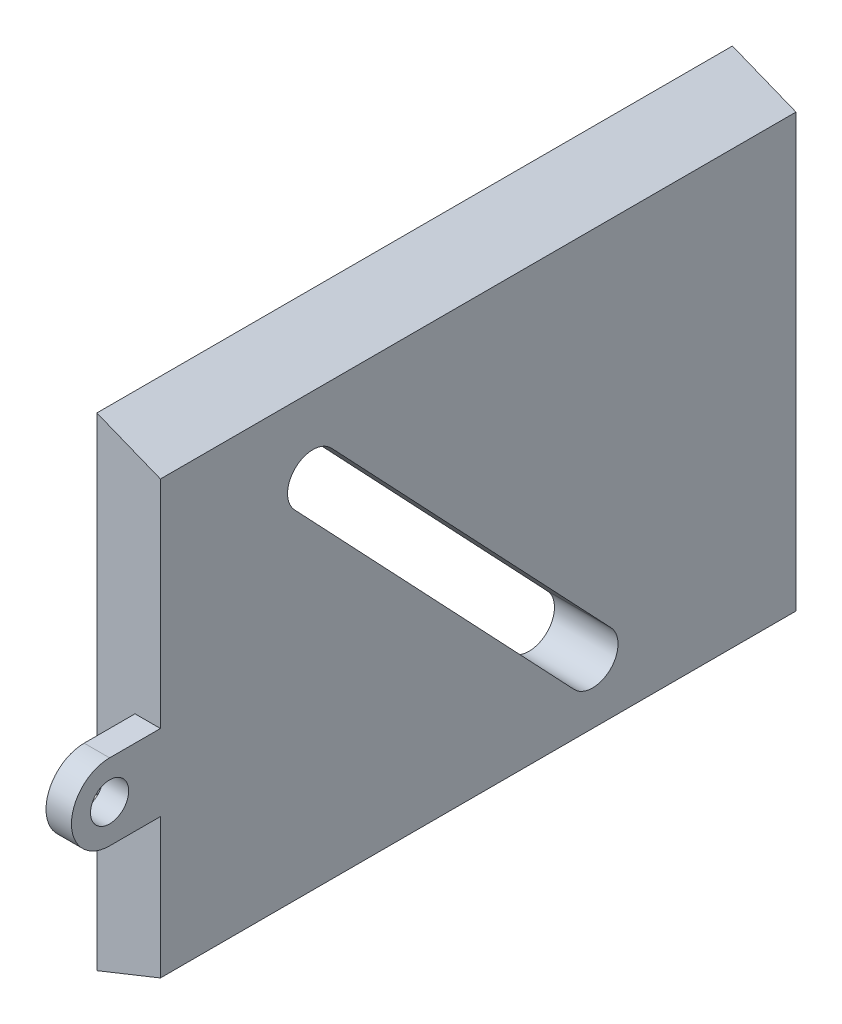
ISO-10303-21;
HEADER;
FILE_DESCRIPTION(('STEP AP214'),'2;1');
FILE_NAME('part.step','',(''),(''),'','','');
FILE_SCHEMA(('AUTOMOTIVE_DESIGN { 1 0 10303 214 1 1 1 1 }'));
ENDSEC;
DATA;
#1=APPLICATION_CONTEXT('core data for automotive mechanical design processes');
#2=APPLICATION_PROTOCOL_DEFINITION('international standard','automotive_design',2000,#1);
#3=PRODUCT_CONTEXT('',#1,'mechanical');
#4=PRODUCT('Part','Part','',(#3));
#5=PRODUCT_RELATED_PRODUCT_CATEGORY('part','',(#4));
#6=PRODUCT_DEFINITION_FORMATION('','',#4);
#7=PRODUCT_DEFINITION_CONTEXT('part definition',#1,'design');
#8=PRODUCT_DEFINITION('design','',#6,#7);
#9=PRODUCT_DEFINITION_SHAPE('','',#8);
#10=(LENGTH_UNIT() NAMED_UNIT(*) SI_UNIT(.MILLI.,.METRE.));
#11=(NAMED_UNIT(*) PLANE_ANGLE_UNIT() SI_UNIT($,.RADIAN.));
#12=(NAMED_UNIT(*) SI_UNIT($,.STERADIAN.) SOLID_ANGLE_UNIT());
#13=UNCERTAINTY_MEASURE_WITH_UNIT(LENGTH_MEASURE(1.E-05),#10,'distance_accuracy_value','');
#14=(GEOMETRIC_REPRESENTATION_CONTEXT(3) GLOBAL_UNCERTAINTY_ASSIGNED_CONTEXT((#13)) GLOBAL_UNIT_ASSIGNED_CONTEXT((#10,
#11,#12)) REPRESENTATION_CONTEXT('',''));
#15=CARTESIAN_POINT('',(0.,0.,0.));
#16=DIRECTION('',(0.,0.,1.));
#17=DIRECTION('',(1.,0.,0.));
#18=AXIS2_PLACEMENT_3D('',#15,#16,#17);
#19=CARTESIAN_POINT('',(4.99999999999999,2.,50.));
#20=DIRECTION('',(-1.,0.,0.));
#21=DIRECTION('',(0.,0.,1.));
#22=AXIS2_PLACEMENT_3D('',#19,#20,#21);
#23=PLANE('',#22);
#24=DIRECTION('',(0.,-0.726184377413891,-0.6875));
#25=VECTOR('',#24,1.);
#26=CARTESIAN_POINT('',(5.,28.625,39.4523687548278));
#27=LINE('',#26,#25);
#28=CARTESIAN_POINT('',(4.99999999999999,28.625,39.4523687548278));
#29=VERTEX_POINT('',#28);
#30=CARTESIAN_POINT('',(4.99999999999999,5.38709992275552,17.4523687548278));
#31=VERTEX_POINT('',#30);
#32=EDGE_CURVE('E148',#29,#31,#27,.T.);
#33=ORIENTED_EDGE('',*,*,#32,.F.);
#34=CARTESIAN_POINT('',(5.,30.,38.));
#35=DIRECTION('',(1.,0.,0.));
#36=DIRECTION('',(0.,1.,0.));
#37=AXIS2_PLACEMENT_3D('',#34,#35,#36);
#38=CIRCLE('',#37,1.99999999999999);
#39=CARTESIAN_POINT('',(5.,31.375,36.5476312451722));
#40=VERTEX_POINT('',#39);
#41=EDGE_CURVE('E48',#40,#29,#38,.T.);
#42=ORIENTED_EDGE('',*,*,#41,.F.);
#43=DIRECTION('',(0.,0.72618437741389,0.6875));
#44=VECTOR('',#43,1.);
#45=CARTESIAN_POINT('',(5.,31.375,36.5476312451722));
#46=LINE('',#45,#44);
#47=CARTESIAN_POINT('',(4.99999999999999,8.13709992275552,14.5476312451722));
#48=VERTEX_POINT('',#47);
#49=EDGE_CURVE('E139',#48,#40,#46,.T.);
#50=ORIENTED_EDGE('',*,*,#49,.F.);
#51=CARTESIAN_POINT('',(4.99999999999999,6.76209992275552,16.));
#52=DIRECTION('',(1.,0.,0.));
#53=DIRECTION('',(0.,1.,0.));
#54=AXIS2_PLACEMENT_3D('',#51,#52,#53);
#55=CIRCLE('',#54,2.);
#56=EDGE_CURVE('E142',#31,#48,#55,.T.);
#57=ORIENTED_EDGE('',*,*,#56,.F.);
#58=EDGE_LOOP('',(#33,#42,#50,#57));
#59=FACE_BOUND('',#58,.T.);
#60=DIRECTION('',(0.,1.,0.));
#61=VECTOR('',#60,1.);
#62=CARTESIAN_POINT('',(4.99999999999999,2.,50.));
#63=LINE('',#62,#61);
#64=CARTESIAN_POINT('',(5.,19.,50.));
#65=VERTEX_POINT('',#64);
#66=CARTESIAN_POINT('',(4.99999999999999,36.,50.));
#67=VERTEX_POINT('',#66);
#68=EDGE_CURVE('E195',#65,#67,#63,.T.);
#69=ORIENTED_EDGE('',*,*,#68,.F.);
#70=DIRECTION('',(0.,0.,1.));
#71=VECTOR('',#70,1.);
#72=CARTESIAN_POINT('',(5.,19.,50.));
#73=LINE('',#72,#71);
#74=CARTESIAN_POINT('',(5.,19.,54.));
#75=VERTEX_POINT('',#74);
#76=EDGE_CURVE('E161',#65,#75,#73,.T.);
#77=ORIENTED_EDGE('',*,*,#76,.T.);
#78=CARTESIAN_POINT('',(5.,16.,54.));
#79=DIRECTION('',(1.,0.,0.));
#80=DIRECTION('',(0.,1.,0.));
#81=AXIS2_PLACEMENT_3D('',#78,#79,#80);
#82=CIRCLE('',#81,3.);
#83=CARTESIAN_POINT('',(5.,13.,54.));
#84=VERTEX_POINT('',#83);
#85=EDGE_CURVE('E177',#75,#84,#82,.T.);
#86=ORIENTED_EDGE('',*,*,#85,.T.);
#87=DIRECTION('',(0.,0.,-1.));
#88=VECTOR('',#87,1.);
#89=CARTESIAN_POINT('',(5.,13.,50.));
#90=LINE('',#89,#88);
#91=CARTESIAN_POINT('',(4.99999999999999,13.,50.));
#92=VERTEX_POINT('',#91);
#93=EDGE_CURVE('E168',#84,#92,#90,.T.);
#94=ORIENTED_EDGE('',*,*,#93,.T.);
#95=CARTESIAN_POINT('',(4.99999999999999,2.,50.));
#96=VERTEX_POINT('',#95);
#97=EDGE_CURVE('E192',#96,#92,#63,.T.);
#98=ORIENTED_EDGE('',*,*,#97,.F.);
#99=DIRECTION('',(0.,0.,-1.));
#100=VECTOR('',#99,1.);
#101=CARTESIAN_POINT('',(4.99999999999999,2.,50.));
#102=LINE('',#101,#100);
#103=CARTESIAN_POINT('',(4.99999999999999,2.,0.));
#104=VERTEX_POINT('',#103);
#105=EDGE_CURVE('E201',#96,#104,#102,.T.);
#106=ORIENTED_EDGE('',*,*,#105,.T.);
#107=DIRECTION('',(0.,1.,0.));
#108=VECTOR('',#107,1.);
#109=CARTESIAN_POINT('',(4.99999999999999,2.,0.));
#110=LINE('',#109,#108);
#111=CARTESIAN_POINT('',(4.99999999999999,36.,0.));
#112=VERTEX_POINT('',#111);
#113=EDGE_CURVE('E185',#104,#112,#110,.T.);
#114=ORIENTED_EDGE('',*,*,#113,.T.);
#115=DIRECTION('',(0.,0.,-1.));
#116=VECTOR('',#115,1.);
#117=CARTESIAN_POINT('',(4.99999999999999,36.,50.));
#118=LINE('',#117,#116);
#119=EDGE_CURVE('E41',#67,#112,#118,.T.);
#120=ORIENTED_EDGE('',*,*,#119,.F.);
#121=EDGE_LOOP('',(#69,#77,#86,#94,#98,#106,#114,#120));
#122=FACE_BOUND('',#121,.T.);
#123=CARTESIAN_POINT('',(5.,16.,54.));
#124=DIRECTION('',(1.,0.,0.));
#125=DIRECTION('',(0.,1.,0.));
#126=AXIS2_PLACEMENT_3D('',#123,#124,#125);
#127=CIRCLE('',#126,1.5);
#128=CARTESIAN_POINT('',(5.,17.5,54.));
#129=VERTEX_POINT('',#128);
#130=EDGE_CURVE('E154',#129,#129,#127,.T.);
#131=ORIENTED_EDGE('',*,*,#130,.F.);
#132=EDGE_LOOP('',(#131));
#133=FACE_BOUND('',#132,.T.);
#134=ADVANCED_FACE('F34',(#59,#122,#133),#23,.F.);
#135=CARTESIAN_POINT('',(4.99999999999999,36.,50.));
#136=DIRECTION('',(-0.371390676354105,-0.928476690885259,0.));
#137=DIRECTION('',(0.928476690885259,-0.371390676354105,0.));
#138=AXIS2_PLACEMENT_3D('',#135,#136,#137);
#139=PLANE('',#138);
#140=DIRECTION('',(-0.928476690885259,0.371390676354105,0.));
#141=VECTOR('',#140,1.);
#142=CARTESIAN_POINT('',(4.99999999999999,36.,0.));
#143=LINE('',#142,#141);
#144=CARTESIAN_POINT('',(0.,38.,0.));
#145=VERTEX_POINT('',#144);
#146=EDGE_CURVE('E204',#112,#145,#143,.T.);
#147=ORIENTED_EDGE('',*,*,#146,.T.);
#148=DIRECTION('',(0.,0.,-1.));
#149=VECTOR('',#148,1.);
#150=CARTESIAN_POINT('',(0.,38.,50.));
#151=LINE('',#150,#149);
#152=CARTESIAN_POINT('',(0.,38.,50.));
#153=VERTEX_POINT('',#152);
#154=EDGE_CURVE('E215',#153,#145,#151,.T.);
#155=ORIENTED_EDGE('',*,*,#154,.F.);
#156=DIRECTION('',(-0.928476690885259,0.371390676354105,0.));
#157=VECTOR('',#156,1.);
#158=CARTESIAN_POINT('',(4.99999999999999,36.,50.));
#159=LINE('',#158,#157);
#160=EDGE_CURVE('E194',#67,#153,#159,.T.);
#161=ORIENTED_EDGE('',*,*,#160,.F.);
#162=ORIENTED_EDGE('',*,*,#119,.T.);
#163=EDGE_LOOP('',(#147,#155,#161,#162));
#164=FACE_BOUND('',#163,.T.);
#165=ADVANCED_FACE('F221',(#164),#139,.F.);
#166=CARTESIAN_POINT('',(0.,38.,50.));
#167=DIRECTION('',(1.,0.,0.));
#168=DIRECTION('',(0.,0.,-1.));
#169=AXIS2_PLACEMENT_3D('',#166,#167,#168);
#170=PLANE('',#169);
#171=DIRECTION('',(0.,0.72618437741389,0.6875));
#172=VECTOR('',#171,1.);
#173=CARTESIAN_POINT('',(0.,31.375,36.5476312451722));
#174=LINE('',#173,#172);
#175=CARTESIAN_POINT('',(0.,8.13709992275552,14.5476312451722));
#176=VERTEX_POINT('',#175);
#177=CARTESIAN_POINT('',(0.,31.375,36.5476312451722));
#178=VERTEX_POINT('',#177);
#179=EDGE_CURVE('E129',#176,#178,#174,.T.);
#180=ORIENTED_EDGE('',*,*,#179,.T.);
#181=CARTESIAN_POINT('',(0.,30.,38.));
#182=DIRECTION('',(1.,0.,0.));
#183=DIRECTION('',(0.,1.,0.));
#184=AXIS2_PLACEMENT_3D('',#181,#182,#183);
#185=CIRCLE('',#184,1.99999999999999);
#186=CARTESIAN_POINT('',(0.,28.625,39.4523687548278));
#187=VERTEX_POINT('',#186);
#188=EDGE_CURVE('E123',#178,#187,#185,.T.);
#189=ORIENTED_EDGE('',*,*,#188,.T.);
#190=DIRECTION('',(0.,-0.726184377413891,-0.6875));
#191=VECTOR('',#190,1.);
#192=CARTESIAN_POINT('',(0.,28.625,39.4523687548278));
#193=LINE('',#192,#191);
#194=CARTESIAN_POINT('',(0.,5.38709992275552,17.4523687548278));
#195=VERTEX_POINT('',#194);
#196=EDGE_CURVE('E132',#187,#195,#193,.T.);
#197=ORIENTED_EDGE('',*,*,#196,.T.);
#198=CARTESIAN_POINT('',(0.,6.76209992275552,16.));
#199=DIRECTION('',(1.,0.,0.));
#200=DIRECTION('',(0.,1.,0.));
#201=AXIS2_PLACEMENT_3D('',#198,#199,#200);
#202=CIRCLE('',#201,2.);
#203=EDGE_CURVE('E56',#195,#176,#202,.T.);
#204=ORIENTED_EDGE('',*,*,#203,.T.);
#205=EDGE_LOOP('',(#180,#189,#197,#204));
#206=FACE_BOUND('',#205,.T.);
#207=DIRECTION('',(0.,-1.,0.));
#208=VECTOR('',#207,1.);
#209=CARTESIAN_POINT('',(0.,38.,0.));
#210=LINE('',#209,#208);
#211=CARTESIAN_POINT('',(0.,0.,0.));
#212=VERTEX_POINT('',#211);
#213=EDGE_CURVE('E206',#145,#212,#210,.T.);
#214=ORIENTED_EDGE('',*,*,#213,.T.);
#215=DIRECTION('',(0.,0.,-1.));
#216=VECTOR('',#215,1.);
#217=CARTESIAN_POINT('',(0.,0.,50.));
#218=LINE('',#217,#216);
#219=CARTESIAN_POINT('',(0.,0.,50.));
#220=VERTEX_POINT('',#219);
#221=EDGE_CURVE('E212',#220,#212,#218,.T.);
#222=ORIENTED_EDGE('',*,*,#221,.F.);
#223=DIRECTION('',(0.,-1.,0.));
#224=VECTOR('',#223,1.);
#225=CARTESIAN_POINT('',(0.,38.,50.));
#226=LINE('',#225,#224);
#227=EDGE_CURVE('E197',#153,#220,#226,.T.);
#228=ORIENTED_EDGE('',*,*,#227,.F.);
#229=ORIENTED_EDGE('',*,*,#154,.T.);
#230=EDGE_LOOP('',(#214,#222,#228,#229));
#231=FACE_BOUND('',#230,.T.);
#232=ADVANCED_FACE('F136',(#206,#231),#170,.F.);
#233=CARTESIAN_POINT('',(0.,0.,50.));
#234=DIRECTION('',(-0.371390676354105,0.928476690885259,0.));
#235=DIRECTION('',(-0.928476690885259,-0.371390676354105,0.));
#236=AXIS2_PLACEMENT_3D('',#233,#234,#235);
#237=PLANE('',#236);
#238=DIRECTION('',(0.928476690885259,0.371390676354105,0.));
#239=VECTOR('',#238,1.);
#240=CARTESIAN_POINT('',(0.,0.,0.));
#241=LINE('',#240,#239);
#242=EDGE_CURVE('E208',#212,#104,#241,.T.);
#243=ORIENTED_EDGE('',*,*,#242,.T.);
#244=ORIENTED_EDGE('',*,*,#105,.F.);
#245=DIRECTION('',(0.928476690885259,0.371390676354105,0.));
#246=VECTOR('',#245,1.);
#247=CARTESIAN_POINT('',(0.,0.,50.));
#248=LINE('',#247,#246);
#249=EDGE_CURVE('E199',#220,#96,#248,.T.);
#250=ORIENTED_EDGE('',*,*,#249,.F.);
#251=ORIENTED_EDGE('',*,*,#221,.T.);
#252=EDGE_LOOP('',(#243,#244,#250,#251));
#253=FACE_BOUND('',#252,.T.);
#254=ADVANCED_FACE('F236',(#253),#237,.F.);
#255=CARTESIAN_POINT('',(0.,0.,50.));
#256=DIRECTION('',(0.,0.,1.));
#257=DIRECTION('',(1.,0.,0.));
#258=AXIS2_PLACEMENT_3D('',#255,#256,#257);
#259=PLANE('',#258);
#260=DIRECTION('',(1.,0.,0.));
#261=VECTOR('',#260,1.);
#262=CARTESIAN_POINT('',(3.,13.,50.));
#263=LINE('',#262,#261);
#264=CARTESIAN_POINT('',(3.,13.,50.));
#265=VERTEX_POINT('',#264);
#266=EDGE_CURVE('E182',#265,#92,#263,.T.);
#267=ORIENTED_EDGE('',*,*,#266,.F.);
#268=DIRECTION('',(0.,1.,0.));
#269=VECTOR('',#268,1.);
#270=CARTESIAN_POINT('',(2.99999999999999,0.,50.));
#271=LINE('',#270,#269);
#272=CARTESIAN_POINT('',(3.,19.,50.));
#273=VERTEX_POINT('',#272);
#274=EDGE_CURVE('E11',#265,#273,#271,.T.);
#275=ORIENTED_EDGE('',*,*,#274,.T.);
#276=DIRECTION('',(1.,0.,0.));
#277=VECTOR('',#276,1.);
#278=CARTESIAN_POINT('',(3.,19.,50.));
#279=LINE('',#278,#277);
#280=EDGE_CURVE('E174',#273,#65,#279,.T.);
#281=ORIENTED_EDGE('',*,*,#280,.T.);
#282=ORIENTED_EDGE('',*,*,#68,.T.);
#283=ORIENTED_EDGE('',*,*,#160,.T.);
#284=ORIENTED_EDGE('',*,*,#227,.T.);
#285=ORIENTED_EDGE('',*,*,#249,.T.);
#286=ORIENTED_EDGE('',*,*,#97,.T.);
#287=EDGE_LOOP('',(#267,#275,#281,#282,#283,#284,#285,#286));
#288=FACE_BOUND('',#287,.T.);
#289=ADVANCED_FACE('F238',(#288),#259,.T.);
#290=CARTESIAN_POINT('',(0.,0.,0.));
#291=DIRECTION('',(0.,0.,1.));
#292=DIRECTION('',(1.,0.,0.));
#293=AXIS2_PLACEMENT_3D('',#290,#291,#292);
#294=PLANE('',#293);
#295=ORIENTED_EDGE('',*,*,#113,.F.);
#296=ORIENTED_EDGE('',*,*,#242,.F.);
#297=ORIENTED_EDGE('',*,*,#213,.F.);
#298=ORIENTED_EDGE('',*,*,#146,.F.);
#299=EDGE_LOOP('',(#295,#296,#297,#298));
#300=FACE_BOUND('',#299,.T.);
#301=ADVANCED_FACE('F230',(#300),#294,.F.);
#302=CARTESIAN_POINT('',(3.,13.,50.));
#303=DIRECTION('',(0.,-1.,0.));
#304=DIRECTION('',(1.,0.,0.));
#305=AXIS2_PLACEMENT_3D('',#302,#303,#304);
#306=PLANE('',#305);
#307=ORIENTED_EDGE('',*,*,#93,.F.);
#308=DIRECTION('',(1.,0.,0.));
#309=VECTOR('',#308,1.);
#310=CARTESIAN_POINT('',(3.,13.,54.));
#311=LINE('',#310,#309);
#312=CARTESIAN_POINT('',(3.,13.,54.));
#313=VERTEX_POINT('',#312);
#314=EDGE_CURVE('E186',#313,#84,#311,.T.);
#315=ORIENTED_EDGE('',*,*,#314,.F.);
#316=DIRECTION('',(0.,0.,-1.));
#317=VECTOR('',#316,1.);
#318=CARTESIAN_POINT('',(3.,13.,50.));
#319=LINE('',#318,#317);
#320=EDGE_CURVE('E171',#313,#265,#319,.T.);
#321=ORIENTED_EDGE('',*,*,#320,.T.);
#322=ORIENTED_EDGE('',*,*,#266,.T.);
#323=EDGE_LOOP('',(#307,#315,#321,#322));
#324=FACE_BOUND('',#323,.T.);
#325=ADVANCED_FACE('F251',(#324),#306,.T.);
#326=CARTESIAN_POINT('',(3.,16.,54.));
#327=DIRECTION('',(1.,0.,0.));
#328=DIRECTION('',(0.,1.,0.));
#329=AXIS2_PLACEMENT_3D('',#326,#327,#328);
#330=CYLINDRICAL_SURFACE('',#329,3.);
#331=ORIENTED_EDGE('',*,*,#85,.F.);
#332=DIRECTION('',(1.,0.,0.));
#333=VECTOR('',#332,1.);
#334=CARTESIAN_POINT('',(3.,19.,54.));
#335=LINE('',#334,#333);
#336=CARTESIAN_POINT('',(3.,19.,54.));
#337=VERTEX_POINT('',#336);
#338=EDGE_CURVE('E188',#337,#75,#335,.T.);
#339=ORIENTED_EDGE('',*,*,#338,.F.);
#340=CARTESIAN_POINT('',(3.,16.,54.));
#341=DIRECTION('',(1.,0.,0.));
#342=DIRECTION('',(0.,1.,0.));
#343=AXIS2_PLACEMENT_3D('',#340,#341,#342);
#344=CIRCLE('',#343,3.);
#345=EDGE_CURVE('E167',#337,#313,#344,.T.);
#346=ORIENTED_EDGE('',*,*,#345,.T.);
#347=ORIENTED_EDGE('',*,*,#314,.T.);
#348=EDGE_LOOP('',(#331,#339,#346,#347));
#349=FACE_BOUND('',#348,.T.);
#350=ADVANCED_FACE('F248',(#349),#330,.T.);
#351=CARTESIAN_POINT('',(3.,19.,50.));
#352=DIRECTION('',(0.,1.,0.));
#353=DIRECTION('',(-1.,0.,0.));
#354=AXIS2_PLACEMENT_3D('',#351,#352,#353);
#355=PLANE('',#354);
#356=ORIENTED_EDGE('',*,*,#76,.F.);
#357=ORIENTED_EDGE('',*,*,#280,.F.);
#358=DIRECTION('',(0.,0.,1.));
#359=VECTOR('',#358,1.);
#360=CARTESIAN_POINT('',(3.,19.,50.));
#361=LINE('',#360,#359);
#362=EDGE_CURVE('E164',#273,#337,#361,.T.);
#363=ORIENTED_EDGE('',*,*,#362,.T.);
#364=ORIENTED_EDGE('',*,*,#338,.T.);
#365=EDGE_LOOP('',(#356,#357,#363,#364));
#366=FACE_BOUND('',#365,.T.);
#367=ADVANCED_FACE('F244',(#366),#355,.T.);
#368=CARTESIAN_POINT('',(3.,16.,50.));
#369=DIRECTION('',(1.,0.,0.));
#370=DIRECTION('',(0.,1.,0.));
#371=AXIS2_PLACEMENT_3D('',#368,#369,#370);
#372=PLANE('',#371);
#373=ORIENTED_EDGE('',*,*,#274,.F.);
#374=ORIENTED_EDGE('',*,*,#320,.F.);
#375=ORIENTED_EDGE('',*,*,#345,.F.);
#376=ORIENTED_EDGE('',*,*,#362,.F.);
#377=EDGE_LOOP('',(#373,#374,#375,#376));
#378=FACE_BOUND('',#377,.T.);
#379=CARTESIAN_POINT('',(3.,16.,54.));
#380=DIRECTION('',(1.,0.,0.));
#381=DIRECTION('',(0.,1.,0.));
#382=AXIS2_PLACEMENT_3D('',#379,#380,#381);
#383=CIRCLE('',#382,1.5);
#384=CARTESIAN_POINT('',(3.,17.5,54.));
#385=VERTEX_POINT('',#384);
#386=EDGE_CURVE('E158',#385,#385,#383,.T.);
#387=ORIENTED_EDGE('',*,*,#386,.T.);
#388=EDGE_LOOP('',(#387));
#389=FACE_BOUND('',#388,.T.);
#390=ADVANCED_FACE('F254',(#378,#389),#372,.F.);
#391=CARTESIAN_POINT('',(3.,16.,54.));
#392=DIRECTION('',(1.,0.,0.));
#393=DIRECTION('',(0.,1.,0.));
#394=AXIS2_PLACEMENT_3D('',#391,#392,#393);
#395=CYLINDRICAL_SURFACE('',#394,1.5);
#396=ORIENTED_EDGE('',*,*,#386,.F.);
#397=EDGE_LOOP('',(#396));
#398=FACE_BOUND('',#397,.T.);
#399=ORIENTED_EDGE('',*,*,#130,.T.);
#400=EDGE_LOOP('',(#399));
#401=FACE_BOUND('',#400,.T.);
#402=ADVANCED_FACE('F257',(#398,#401),#395,.F.);
#403=CARTESIAN_POINT('',(0.,30.,38.));
#404=DIRECTION('',(1.,0.,0.));
#405=DIRECTION('',(0.,1.,0.));
#406=AXIS2_PLACEMENT_3D('',#403,#404,#405);
#407=CYLINDRICAL_SURFACE('',#406,1.99999999999999);
#408=ORIENTED_EDGE('',*,*,#41,.T.);
#409=DIRECTION('',(1.,0.,0.));
#410=VECTOR('',#409,1.);
#411=CARTESIAN_POINT('',(0.,28.625,39.4523687548278));
#412=LINE('',#411,#410);
#413=EDGE_CURVE('E119',#187,#29,#412,.T.);
#414=ORIENTED_EDGE('',*,*,#413,.F.);
#415=ORIENTED_EDGE('',*,*,#188,.F.);
#416=DIRECTION('',(1.,0.,0.));
#417=VECTOR('',#416,1.);
#418=CARTESIAN_POINT('',(0.,31.375,36.5476312451722));
#419=LINE('',#418,#417);
#420=EDGE_CURVE('E152',#178,#40,#419,.T.);
#421=ORIENTED_EDGE('',*,*,#420,.T.);
#422=EDGE_LOOP('',(#408,#414,#415,#421));
#423=FACE_BOUND('',#422,.T.);
#424=ADVANCED_FACE('F121',(#423),#407,.F.);
#425=CARTESIAN_POINT('',(0.,31.375,36.5476312451722));
#426=DIRECTION('',(0.,0.6875,-0.72618437741389));
#427=DIRECTION('',(0.,0.72618437741389,0.6875));
#428=AXIS2_PLACEMENT_3D('',#425,#426,#427);
#429=PLANE('',#428);
#430=ORIENTED_EDGE('',*,*,#49,.T.);
#431=ORIENTED_EDGE('',*,*,#420,.F.);
#432=ORIENTED_EDGE('',*,*,#179,.F.);
#433=DIRECTION('',(1.,0.,0.));
#434=VECTOR('',#433,1.);
#435=CARTESIAN_POINT('',(0.,8.13709992275552,14.5476312451722));
#436=LINE('',#435,#434);
#437=EDGE_CURVE('E155',#176,#48,#436,.T.);
#438=ORIENTED_EDGE('',*,*,#437,.T.);
#439=EDGE_LOOP('',(#430,#431,#432,#438));
#440=FACE_BOUND('',#439,.T.);
#441=ADVANCED_FACE('F274',(#440),#429,.F.);
#442=CARTESIAN_POINT('',(0.,6.76209992275552,16.));
#443=DIRECTION('',(1.,0.,0.));
#444=DIRECTION('',(0.,1.,0.));
#445=AXIS2_PLACEMENT_3D('',#442,#443,#444);
#446=CYLINDRICAL_SURFACE('',#445,2.);
#447=ORIENTED_EDGE('',*,*,#56,.T.);
#448=ORIENTED_EDGE('',*,*,#437,.F.);
#449=ORIENTED_EDGE('',*,*,#203,.F.);
#450=DIRECTION('',(1.,0.,0.));
#451=VECTOR('',#450,1.);
#452=CARTESIAN_POINT('',(0.,5.38709992275552,17.4523687548278));
#453=LINE('',#452,#451);
#454=EDGE_CURVE('E128',#195,#31,#453,.T.);
#455=ORIENTED_EDGE('',*,*,#454,.T.);
#456=EDGE_LOOP('',(#447,#448,#449,#455));
#457=FACE_BOUND('',#456,.T.);
#458=ADVANCED_FACE('F272',(#457),#446,.F.);
#459=CARTESIAN_POINT('',(0.,28.625,39.4523687548278));
#460=DIRECTION('',(0.,-0.6875,0.726184377413891));
#461=DIRECTION('',(0.,-0.726184377413891,-0.6875));
#462=AXIS2_PLACEMENT_3D('',#459,#460,#461);
#463=PLANE('',#462);
#464=ORIENTED_EDGE('',*,*,#32,.T.);
#465=ORIENTED_EDGE('',*,*,#454,.F.);
#466=ORIENTED_EDGE('',*,*,#196,.F.);
#467=ORIENTED_EDGE('',*,*,#413,.T.);
#468=EDGE_LOOP('',(#464,#465,#466,#467));
#469=FACE_BOUND('',#468,.T.);
#470=ADVANCED_FACE('F133',(#469),#463,.F.);
#471=CLOSED_SHELL('',(#134,#165,#232,#254,#289,#301,#325,#350,#367,#390,#402,#424,#441,#458,#470));
#472=MANIFOLD_SOLID_BREP('B2',#471);
#473=ADVANCED_BREP_SHAPE_REPRESENTATION('',(#18,#472),#14);
#474=SHAPE_DEFINITION_REPRESENTATION(#9,#473);
ENDSEC;
END-ISO-10303-21;
